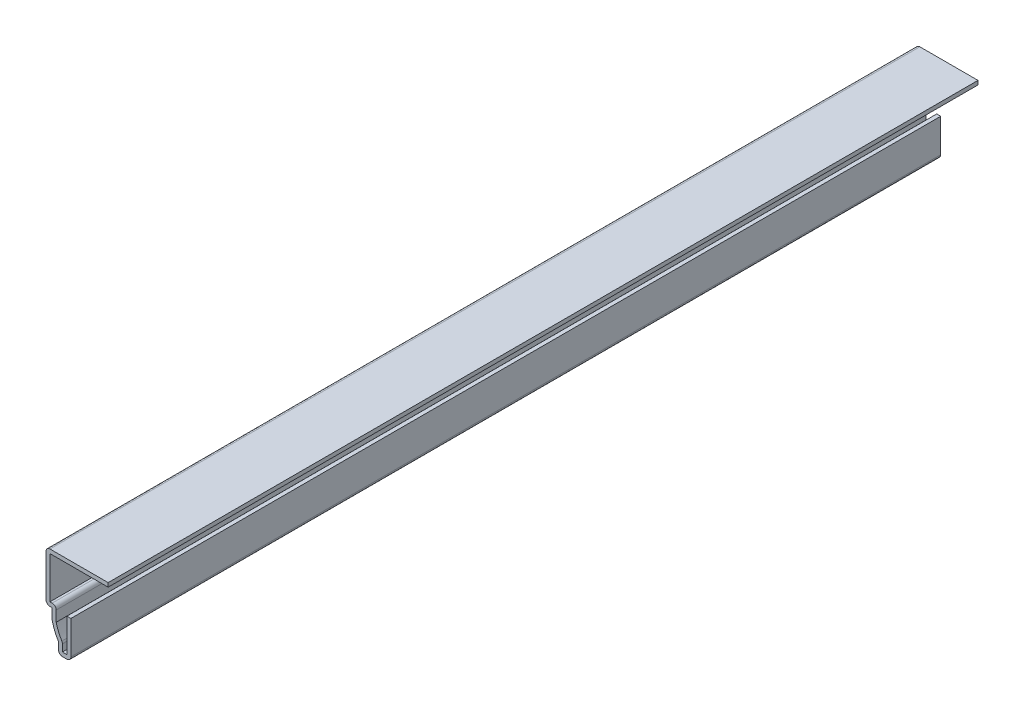
ISO-10303-21;
HEADER;
FILE_DESCRIPTION(('STEP AP214'),'2;1');
FILE_NAME('part.step','',(''),(''),'','','');
FILE_SCHEMA(('AUTOMOTIVE_DESIGN { 1 0 10303 214 1 1 1 1 }'));
ENDSEC;
DATA;
#1=APPLICATION_CONTEXT('core data for automotive mechanical design processes');
#2=APPLICATION_PROTOCOL_DEFINITION('international standard','automotive_design',2000,#1);
#3=PRODUCT_CONTEXT('',#1,'mechanical');
#4=PRODUCT('Part','Part','',(#3));
#5=PRODUCT_RELATED_PRODUCT_CATEGORY('part','',(#4));
#6=PRODUCT_DEFINITION_FORMATION('','',#4);
#7=PRODUCT_DEFINITION_CONTEXT('part definition',#1,'design');
#8=PRODUCT_DEFINITION('design','',#6,#7);
#9=PRODUCT_DEFINITION_SHAPE('','',#8);
#10=(LENGTH_UNIT() NAMED_UNIT(*) SI_UNIT(.MILLI.,.METRE.));
#11=(NAMED_UNIT(*) PLANE_ANGLE_UNIT() SI_UNIT($,.RADIAN.));
#12=(NAMED_UNIT(*) SI_UNIT($,.STERADIAN.) SOLID_ANGLE_UNIT());
#13=UNCERTAINTY_MEASURE_WITH_UNIT(LENGTH_MEASURE(1.E-05),#10,'distance_accuracy_value','');
#14=(GEOMETRIC_REPRESENTATION_CONTEXT(3) GLOBAL_UNCERTAINTY_ASSIGNED_CONTEXT((#13)) GLOBAL_UNIT_ASSIGNED_CONTEXT((#10,
#11,#12)) REPRESENTATION_CONTEXT('',''));
#15=CARTESIAN_POINT('',(0.,0.,0.));
#16=DIRECTION('',(0.,0.,1.));
#17=DIRECTION('',(1.,0.,0.));
#18=AXIS2_PLACEMENT_3D('',#15,#16,#17);
#19=CARTESIAN_POINT('',(-6.35,11.684,-222.25));
#20=DIRECTION('',(0.,-1.,0.));
#21=DIRECTION('',(0.,0.,-1.));
#22=AXIS2_PLACEMENT_3D('',#19,#20,#21);
#23=PLANE('',#22);
#24=DIRECTION('',(1.,0.,0.));
#25=VECTOR('',#24,1.);
#26=CARTESIAN_POINT('',(-6.35,11.684,0.));
#27=LINE('',#26,#25);
#28=CARTESIAN_POINT('',(-5.334,11.684,0.));
#29=VERTEX_POINT('',#28);
#30=CARTESIAN_POINT('',(9.525,11.684,0.));
#31=VERTEX_POINT('',#30);
#32=EDGE_CURVE('E272',#29,#31,#27,.T.);
#33=ORIENTED_EDGE('',*,*,#32,.F.);
#34=DIRECTION('',(0.,0.,1.));
#35=VECTOR('',#34,1.);
#36=CARTESIAN_POINT('',(-5.334,11.684,-222.25));
#37=LINE('',#36,#35);
#38=CARTESIAN_POINT('',(-5.334,11.684,-222.25));
#39=VERTEX_POINT('',#38);
#40=EDGE_CURVE('E227',#39,#29,#37,.T.);
#41=ORIENTED_EDGE('',*,*,#40,.F.);
#42=DIRECTION('',(1.,0.,0.));
#43=VECTOR('',#42,1.);
#44=CARTESIAN_POINT('',(-6.35,11.684,-222.25));
#45=LINE('',#44,#43);
#46=CARTESIAN_POINT('',(9.525,11.684,-222.25));
#47=VERTEX_POINT('',#46);
#48=EDGE_CURVE('E209',#39,#47,#45,.T.);
#49=ORIENTED_EDGE('',*,*,#48,.T.);
#50=DIRECTION('',(0.,0.,1.));
#51=VECTOR('',#50,1.);
#52=CARTESIAN_POINT('',(9.525,11.684,-222.25));
#53=LINE('',#52,#51);
#54=EDGE_CURVE('E217',#47,#31,#53,.T.);
#55=ORIENTED_EDGE('',*,*,#54,.T.);
#56=EDGE_LOOP('',(#33,#41,#49,#55));
#57=FACE_BOUND('',#56,.T.);
#58=ADVANCED_FACE('F35',(#57),#23,.T.);
#59=CARTESIAN_POINT('',(-5.334,0.,-222.25));
#60=DIRECTION('',(1.,0.,0.));
#61=DIRECTION('',(0.,0.,-1.));
#62=AXIS2_PLACEMENT_3D('',#59,#60,#61);
#63=PLANE('',#62);
#64=DIRECTION('',(0.,1.,0.));
#65=VECTOR('',#64,1.);
#66=CARTESIAN_POINT('',(-5.334,0.,0.));
#67=LINE('',#66,#65);
#68=CARTESIAN_POINT('',(-5.334,1.016,0.));
#69=VERTEX_POINT('',#68);
#70=EDGE_CURVE('E228',#69,#29,#67,.T.);
#71=ORIENTED_EDGE('',*,*,#70,.F.);
#72=DIRECTION('',(0.,0.,1.));
#73=VECTOR('',#72,1.);
#74=CARTESIAN_POINT('',(-5.334,1.016,-222.25));
#75=LINE('',#74,#73);
#76=CARTESIAN_POINT('',(-5.334,1.016,-222.25));
#77=VERTEX_POINT('',#76);
#78=EDGE_CURVE('E314',#77,#69,#75,.T.);
#79=ORIENTED_EDGE('',*,*,#78,.F.);
#80=DIRECTION('',(0.,1.,0.));
#81=VECTOR('',#80,1.);
#82=CARTESIAN_POINT('',(-5.334,0.,-222.25));
#83=LINE('',#82,#81);
#84=EDGE_CURVE('E225',#77,#39,#83,.T.);
#85=ORIENTED_EDGE('',*,*,#84,.T.);
#86=ORIENTED_EDGE('',*,*,#40,.T.);
#87=EDGE_LOOP('',(#71,#79,#85,#86));
#88=FACE_BOUND('',#87,.T.);
#89=ADVANCED_FACE('F414',(#88),#63,.T.);
#90=CARTESIAN_POINT('',(-4.7625,1.016,-222.25));
#91=DIRECTION('',(0.,1.,0.));
#92=DIRECTION('',(0.,0.,1.));
#93=AXIS2_PLACEMENT_3D('',#90,#91,#92);
#94=PLANE('',#93);
#95=DIRECTION('',(1.,0.,0.));
#96=VECTOR('',#95,1.);
#97=CARTESIAN_POINT('',(-4.7625,1.016,0.));
#98=LINE('',#97,#96);
#99=CARTESIAN_POINT('',(-4.7625,1.016,0.));
#100=VERTEX_POINT('',#99);
#101=EDGE_CURVE('E231',#100,#69,#98,.F.);
#102=ORIENTED_EDGE('',*,*,#101,.F.);
#103=DIRECTION('',(0.,0.,1.));
#104=VECTOR('',#103,1.);
#105=CARTESIAN_POINT('',(-4.7625,1.016,-222.25));
#106=LINE('',#105,#104);
#107=CARTESIAN_POINT('',(-4.7625,1.016,-222.25));
#108=VERTEX_POINT('',#107);
#109=EDGE_CURVE('E385',#100,#108,#106,.F.);
#110=ORIENTED_EDGE('',*,*,#109,.T.);
#111=DIRECTION('',(1.,0.,0.));
#112=VECTOR('',#111,1.);
#113=CARTESIAN_POINT('',(-4.7625,1.016,-222.25));
#114=LINE('',#113,#112);
#115=EDGE_CURVE('E269',#108,#77,#114,.F.);
#116=ORIENTED_EDGE('',*,*,#115,.T.);
#117=ORIENTED_EDGE('',*,*,#78,.T.);
#118=EDGE_LOOP('',(#102,#110,#116,#117));
#119=FACE_BOUND('',#118,.T.);
#120=ADVANCED_FACE('F499',(#119),#94,.T.);
#121=CARTESIAN_POINT('',(-3.7465,-2.83139924481161,-222.25));
#122=DIRECTION('',(1.,0.,0.));
#123=DIRECTION('',(0.,0.,-1.));
#124=AXIS2_PLACEMENT_3D('',#121,#122,#123);
#125=PLANE('',#124);
#126=DIRECTION('',(0.,1.,0.));
#127=VECTOR('',#126,1.);
#128=CARTESIAN_POINT('',(-3.7465,-2.83139924481161,-222.25));
#129=LINE('',#128,#127);
#130=CARTESIAN_POINT('',(-3.7465,-2.71427745279967,-222.25));
#131=VERTEX_POINT('',#130);
#132=CARTESIAN_POINT('',(-3.7465,0.,-222.25));
#133=VERTEX_POINT('',#132);
#134=EDGE_CURVE('E266',#131,#133,#129,.T.);
#135=ORIENTED_EDGE('',*,*,#134,.T.);
#136=DIRECTION('',(0.,0.,1.));
#137=VECTOR('',#136,1.);
#138=CARTESIAN_POINT('',(-3.7465,0.,-222.25));
#139=LINE('',#138,#137);
#140=CARTESIAN_POINT('',(-3.7465,0.,0.));
#141=VERTEX_POINT('',#140);
#142=EDGE_CURVE('E382',#133,#141,#139,.T.);
#143=ORIENTED_EDGE('',*,*,#142,.T.);
#144=DIRECTION('',(0.,1.,0.));
#145=VECTOR('',#144,1.);
#146=CARTESIAN_POINT('',(-3.7465,-2.83139924481161,0.));
#147=LINE('',#146,#145);
#148=CARTESIAN_POINT('',(-3.7465,-2.71427745279967,0.));
#149=VERTEX_POINT('',#148);
#150=EDGE_CURVE('E308',#149,#141,#147,.T.);
#151=ORIENTED_EDGE('',*,*,#150,.F.);
#152=DIRECTION('',(0.,0.,1.));
#153=VECTOR('',#152,1.);
#154=CARTESIAN_POINT('',(-3.7465,-2.71427745279967,-222.25));
#155=LINE('',#154,#153);
#156=EDGE_CURVE('E317',#131,#149,#155,.T.);
#157=ORIENTED_EDGE('',*,*,#156,.F.);
#158=EDGE_LOOP('',(#135,#143,#151,#157));
#159=FACE_BOUND('',#158,.T.);
#160=ADVANCED_FACE('F425',(#159),#125,.T.);
#161=CARTESIAN_POINT('',(7.61785453113037,0.,-222.25));
#162=DIRECTION('',(0.,0.,1.));
#163=DIRECTION('',(1.,0.,0.));
#164=AXIS2_PLACEMENT_3D('',#161,#162,#163);
#165=CYLINDRICAL_SURFACE('',#164,11.684);
#166=CARTESIAN_POINT('',(7.61785453113037,0.,0.));
#167=DIRECTION('',(0.,0.,1.));
#168=DIRECTION('',(1.,0.,0.));
#169=AXIS2_PLACEMENT_3D('',#166,#167,#168);
#170=CIRCLE('',#169,11.684);
#171=CARTESIAN_POINT('',(-2.31157163750957,-6.15811269477332,0.));
#172=VERTEX_POINT('',#171);
#173=EDGE_CURVE('E306',#172,#149,#170,.F.);
#174=ORIENTED_EDGE('',*,*,#173,.F.);
#175=DIRECTION('',(0.,0.,1.));
#176=VECTOR('',#175,1.);
#177=CARTESIAN_POINT('',(-2.31157163750957,-6.15811269477332,-222.25));
#178=LINE('',#177,#176);
#179=CARTESIAN_POINT('',(-2.31157163750957,-6.15811269477332,-222.25));
#180=VERTEX_POINT('',#179);
#181=EDGE_CURVE('E352',#172,#180,#178,.F.);
#182=ORIENTED_EDGE('',*,*,#181,.T.);
#183=CARTESIAN_POINT('',(7.61785453113037,0.,-222.25));
#184=DIRECTION('',(0.,0.,1.));
#185=DIRECTION('',(1.,0.,0.));
#186=AXIS2_PLACEMENT_3D('',#183,#184,#185);
#187=CIRCLE('',#186,11.684);
#188=EDGE_CURVE('E264',#180,#131,#187,.F.);
#189=ORIENTED_EDGE('',*,*,#188,.T.);
#190=ORIENTED_EDGE('',*,*,#156,.T.);
#191=EDGE_LOOP('',(#174,#182,#189,#190));
#192=FACE_BOUND('',#191,.T.);
#193=ADVANCED_FACE('F430',(#192),#165,.F.);
#194=CARTESIAN_POINT('',(-2.159,-9.525,-222.25));
#195=DIRECTION('',(1.,0.,0.));
#196=DIRECTION('',(0.,0.,-1.));
#197=AXIS2_PLACEMENT_3D('',#194,#195,#196);
#198=PLANE('',#197);
#199=DIRECTION('',(0.,1.,0.));
#200=VECTOR('',#199,1.);
#201=CARTESIAN_POINT('',(-2.159,-9.525,-222.25));
#202=LINE('',#201,#200);
#203=CARTESIAN_POINT('',(-2.159,-8.509,-222.25));
#204=VERTEX_POINT('',#203);
#205=CARTESIAN_POINT('',(-2.159,-6.69360075518839,-222.25));
#206=VERTEX_POINT('',#205);
#207=EDGE_CURVE('E261',#204,#206,#202,.T.);
#208=ORIENTED_EDGE('',*,*,#207,.T.);
#209=DIRECTION('',(0.,0.,1.));
#210=VECTOR('',#209,1.);
#211=CARTESIAN_POINT('',(-2.159,-6.69360075518839,-222.25));
#212=LINE('',#211,#210);
#213=CARTESIAN_POINT('',(-2.159,-6.69360075518839,0.));
#214=VERTEX_POINT('',#213);
#215=EDGE_CURVE('E313',#206,#214,#212,.T.);
#216=ORIENTED_EDGE('',*,*,#215,.T.);
#217=DIRECTION('',(0.,1.,0.));
#218=VECTOR('',#217,1.);
#219=CARTESIAN_POINT('',(-2.159,-9.525,0.));
#220=LINE('',#219,#218);
#221=CARTESIAN_POINT('',(-2.159,-8.509,0.));
#222=VERTEX_POINT('',#221);
#223=EDGE_CURVE('E303',#222,#214,#220,.T.);
#224=ORIENTED_EDGE('',*,*,#223,.F.);
#225=DIRECTION('',(0.,0.,1.));
#226=VECTOR('',#225,1.);
#227=CARTESIAN_POINT('',(-2.159,-8.509,-222.25));
#228=LINE('',#227,#226);
#229=EDGE_CURVE('E320',#204,#222,#228,.T.);
#230=ORIENTED_EDGE('',*,*,#229,.F.);
#231=EDGE_LOOP('',(#208,#216,#224,#230));
#232=FACE_BOUND('',#231,.T.);
#233=ADVANCED_FACE('F438',(#232),#198,.T.);
#234=CARTESIAN_POINT('',(0.,-8.509,-222.25));
#235=DIRECTION('',(0.,1.,0.));
#236=DIRECTION('',(0.,0.,1.));
#237=AXIS2_PLACEMENT_3D('',#234,#235,#236);
#238=PLANE('',#237);
#239=DIRECTION('',(1.,0.,0.));
#240=VECTOR('',#239,1.);
#241=CARTESIAN_POINT('',(0.,-8.509,0.));
#242=LINE('',#241,#240);
#243=CARTESIAN_POINT('',(-1.016,-8.509,0.));
#244=VERTEX_POINT('',#243);
#245=EDGE_CURVE('E300',#244,#222,#242,.F.);
#246=ORIENTED_EDGE('',*,*,#245,.F.);
#247=DIRECTION('',(0.,0.,1.));
#248=VECTOR('',#247,1.);
#249=CARTESIAN_POINT('',(-1.016,-8.509,-222.25));
#250=LINE('',#249,#248);
#251=CARTESIAN_POINT('',(-1.016,-8.509,-222.25));
#252=VERTEX_POINT('',#251);
#253=EDGE_CURVE('E322',#252,#244,#250,.T.);
#254=ORIENTED_EDGE('',*,*,#253,.F.);
#255=DIRECTION('',(1.,0.,0.));
#256=VECTOR('',#255,1.);
#257=CARTESIAN_POINT('',(0.,-8.509,-222.25));
#258=LINE('',#257,#256);
#259=EDGE_CURVE('E258',#252,#204,#258,.F.);
#260=ORIENTED_EDGE('',*,*,#259,.T.);
#261=ORIENTED_EDGE('',*,*,#229,.T.);
#262=EDGE_LOOP('',(#246,#254,#260,#261));
#263=FACE_BOUND('',#262,.T.);
#264=ADVANCED_FACE('F443',(#263),#238,.T.);
#265=CARTESIAN_POINT('',(-1.016,0.,-222.25));
#266=DIRECTION('',(-1.,0.,0.));
#267=DIRECTION('',(0.,0.,1.));
#268=AXIS2_PLACEMENT_3D('',#265,#266,#267);
#269=PLANE('',#268);
#270=DIRECTION('',(0.,1.,0.));
#271=VECTOR('',#270,1.);
#272=CARTESIAN_POINT('',(-1.016,0.,0.));
#273=LINE('',#272,#271);
#274=CARTESIAN_POINT('',(-1.016,0.,0.));
#275=VERTEX_POINT('',#274);
#276=EDGE_CURVE('E297',#275,#244,#273,.F.);
#277=ORIENTED_EDGE('',*,*,#276,.F.);
#278=DIRECTION('',(0.,0.,1.));
#279=VECTOR('',#278,1.);
#280=CARTESIAN_POINT('',(-1.016,0.,-222.25));
#281=LINE('',#280,#279);
#282=CARTESIAN_POINT('',(-1.016,0.,-222.25));
#283=VERTEX_POINT('',#282);
#284=EDGE_CURVE('E324',#283,#275,#281,.T.);
#285=ORIENTED_EDGE('',*,*,#284,.F.);
#286=DIRECTION('',(0.,1.,0.));
#287=VECTOR('',#286,1.);
#288=CARTESIAN_POINT('',(-1.016,0.,-222.25));
#289=LINE('',#288,#287);
#290=EDGE_CURVE('E255',#283,#252,#289,.F.);
#291=ORIENTED_EDGE('',*,*,#290,.T.);
#292=ORIENTED_EDGE('',*,*,#253,.T.);
#293=EDGE_LOOP('',(#277,#285,#291,#292));
#294=FACE_BOUND('',#293,.T.);
#295=ADVANCED_FACE('F447',(#294),#269,.T.);
#296=CARTESIAN_POINT('',(-1.016,0.,-222.25));
#297=DIRECTION('',(0.,-1.,0.));
#298=DIRECTION('',(0.,0.,-1.));
#299=AXIS2_PLACEMENT_3D('',#296,#297,#298);
#300=PLANE('',#299);
#301=DIRECTION('',(1.,0.,0.));
#302=VECTOR('',#301,1.);
#303=CARTESIAN_POINT('',(-1.016,0.,0.));
#304=LINE('',#303,#302);
#305=CARTESIAN_POINT('',(0.,0.,0.));
#306=VERTEX_POINT('',#305);
#307=EDGE_CURVE('E295',#275,#306,#304,.T.);
#308=ORIENTED_EDGE('',*,*,#307,.T.);
#309=DIRECTION('',(0.,0.,1.));
#310=VECTOR('',#309,1.);
#311=CARTESIAN_POINT('',(0.,0.,-222.25));
#312=LINE('',#311,#310);
#313=CARTESIAN_POINT('',(0.,0.,-222.25));
#314=VERTEX_POINT('',#313);
#315=EDGE_CURVE('E326',#314,#306,#312,.T.);
#316=ORIENTED_EDGE('',*,*,#315,.F.);
#317=DIRECTION('',(1.,0.,0.));
#318=VECTOR('',#317,1.);
#319=CARTESIAN_POINT('',(-1.016,0.,-222.25));
#320=LINE('',#319,#318);
#321=EDGE_CURVE('E253',#283,#314,#320,.T.);
#322=ORIENTED_EDGE('',*,*,#321,.F.);
#323=ORIENTED_EDGE('',*,*,#284,.T.);
#324=EDGE_LOOP('',(#308,#316,#322,#323));
#325=FACE_BOUND('',#324,.T.);
#326=ADVANCED_FACE('F451',(#325),#300,.F.);
#327=CARTESIAN_POINT('',(0.,0.,-222.25));
#328=DIRECTION('',(-1.,0.,0.));
#329=DIRECTION('',(0.,0.,1.));
#330=AXIS2_PLACEMENT_3D('',#327,#328,#329);
#331=PLANE('',#330);
#332=DIRECTION('',(0.,-1.,0.));
#333=VECTOR('',#332,1.);
#334=CARTESIAN_POINT('',(0.,0.,0.));
#335=LINE('',#334,#333);
#336=CARTESIAN_POINT('',(0.,-8.509,0.));
#337=VERTEX_POINT('',#336);
#338=EDGE_CURVE('E292',#306,#337,#335,.T.);
#339=ORIENTED_EDGE('',*,*,#338,.T.);
#340=DIRECTION('',(0.,0.,1.));
#341=VECTOR('',#340,1.);
#342=CARTESIAN_POINT('',(0.,-8.509,-222.25));
#343=LINE('',#342,#341);
#344=CARTESIAN_POINT('',(0.,-8.509,-222.25));
#345=VERTEX_POINT('',#344);
#346=EDGE_CURVE('E377',#337,#345,#343,.F.);
#347=ORIENTED_EDGE('',*,*,#346,.T.);
#348=DIRECTION('',(0.,-1.,0.));
#349=VECTOR('',#348,1.);
#350=CARTESIAN_POINT('',(0.,0.,-222.25));
#351=LINE('',#350,#349);
#352=EDGE_CURVE('E250',#314,#345,#351,.T.);
#353=ORIENTED_EDGE('',*,*,#352,.F.);
#354=ORIENTED_EDGE('',*,*,#315,.T.);
#355=EDGE_LOOP('',(#339,#347,#353,#354));
#356=FACE_BOUND('',#355,.T.);
#357=ADVANCED_FACE('F620',(#356),#331,.F.);
#358=CARTESIAN_POINT('',(0.,-9.525,-222.25));
#359=DIRECTION('',(0.,1.,0.));
#360=DIRECTION('',(0.,0.,1.));
#361=AXIS2_PLACEMENT_3D('',#358,#359,#360);
#362=PLANE('',#361);
#363=DIRECTION('',(-1.,0.,0.));
#364=VECTOR('',#363,1.);
#365=CARTESIAN_POINT('',(0.,-9.525,-222.25));
#366=LINE('',#365,#364);
#367=CARTESIAN_POINT('',(-1.016,-9.525,-222.25));
#368=VERTEX_POINT('',#367);
#369=CARTESIAN_POINT('',(-2.159,-9.525,-222.25));
#370=VERTEX_POINT('',#369);
#371=EDGE_CURVE('E247',#368,#370,#366,.T.);
#372=ORIENTED_EDGE('',*,*,#371,.F.);
#373=DIRECTION('',(0.,0.,1.));
#374=VECTOR('',#373,1.);
#375=CARTESIAN_POINT('',(-1.016,-9.525,-222.25));
#376=LINE('',#375,#374);
#377=CARTESIAN_POINT('',(-1.016,-9.525,0.));
#378=VERTEX_POINT('',#377);
#379=EDGE_CURVE('E374',#368,#378,#376,.T.);
#380=ORIENTED_EDGE('',*,*,#379,.T.);
#381=DIRECTION('',(-1.,0.,0.));
#382=VECTOR('',#381,1.);
#383=CARTESIAN_POINT('',(0.,-9.525,0.));
#384=LINE('',#383,#382);
#385=CARTESIAN_POINT('',(-2.159,-9.525,0.));
#386=VERTEX_POINT('',#385);
#387=EDGE_CURVE('E289',#378,#386,#384,.T.);
#388=ORIENTED_EDGE('',*,*,#387,.T.);
#389=DIRECTION('',(0.,0.,1.));
#390=VECTOR('',#389,1.);
#391=CARTESIAN_POINT('',(-2.159,-9.525,-222.25));
#392=LINE('',#391,#390);
#393=EDGE_CURVE('E372',#386,#370,#392,.F.);
#394=ORIENTED_EDGE('',*,*,#393,.T.);
#395=EDGE_LOOP('',(#372,#380,#388,#394));
#396=FACE_BOUND('',#395,.T.);
#397=ADVANCED_FACE('F462',(#396),#362,.F.);
#398=CARTESIAN_POINT('',(-3.175,-9.525,-222.25));
#399=DIRECTION('',(1.,0.,0.));
#400=DIRECTION('',(0.,0.,-1.));
#401=AXIS2_PLACEMENT_3D('',#398,#399,#400);
#402=PLANE('',#401);
#403=DIRECTION('',(0.,1.,0.));
#404=VECTOR('',#403,1.);
#405=CARTESIAN_POINT('',(-3.175,-9.525,-222.25));
#406=LINE('',#405,#404);
#407=CARTESIAN_POINT('',(-3.175,-8.509,-222.25));
#408=VERTEX_POINT('',#407);
#409=CARTESIAN_POINT('',(-3.175,-6.6936007551884,-222.25));
#410=VERTEX_POINT('',#409);
#411=EDGE_CURVE('E245',#408,#410,#406,.T.);
#412=ORIENTED_EDGE('',*,*,#411,.F.);
#413=DIRECTION('',(0.,0.,1.));
#414=VECTOR('',#413,1.);
#415=CARTESIAN_POINT('',(-3.175,-8.509,-222.25));
#416=LINE('',#415,#414);
#417=CARTESIAN_POINT('',(-3.175,-8.509,0.));
#418=VERTEX_POINT('',#417);
#419=EDGE_CURVE('E379',#408,#418,#416,.T.);
#420=ORIENTED_EDGE('',*,*,#419,.T.);
#421=DIRECTION('',(0.,1.,0.));
#422=VECTOR('',#421,1.);
#423=CARTESIAN_POINT('',(-3.175,-9.525,0.));
#424=LINE('',#423,#422);
#425=CARTESIAN_POINT('',(-3.175,-6.6936007551884,0.));
#426=VERTEX_POINT('',#425);
#427=EDGE_CURVE('E287',#418,#426,#424,.T.);
#428=ORIENTED_EDGE('',*,*,#427,.T.);
#429=DIRECTION('',(0.,0.,1.));
#430=VECTOR('',#429,1.);
#431=CARTESIAN_POINT('',(-3.175,-6.6936007551884,-222.25));
#432=LINE('',#431,#430);
#433=EDGE_CURVE('E329',#410,#426,#432,.T.);
#434=ORIENTED_EDGE('',*,*,#433,.F.);
#435=EDGE_LOOP('',(#412,#420,#428,#434));
#436=FACE_BOUND('',#435,.T.);
#437=ADVANCED_FACE('F473',(#436),#402,.F.);
#438=CARTESIAN_POINT('',(7.61785453113037,0.,-222.25));
#439=DIRECTION('',(0.,0.,1.));
#440=DIRECTION('',(1.,0.,0.));
#441=AXIS2_PLACEMENT_3D('',#438,#439,#440);
#442=CYLINDRICAL_SURFACE('',#441,12.7);
#443=CARTESIAN_POINT('',(7.61785453113037,0.,0.));
#444=DIRECTION('',(0.,0.,-1.));
#445=DIRECTION('',(1.,0.,0.));
#446=AXIS2_PLACEMENT_3D('',#443,#444,#445);
#447=CIRCLE('',#446,12.7);
#448=CARTESIAN_POINT('',(-4.73470474183742,-2.95030157913009,0.));
#449=VERTEX_POINT('',#448);
#450=EDGE_CURVE('E284',#426,#449,#447,.T.);
#451=ORIENTED_EDGE('',*,*,#450,.T.);
#452=DIRECTION('',(0.,0.,1.));
#453=VECTOR('',#452,1.);
#454=CARTESIAN_POINT('',(-4.73470474183742,-2.95030157913009,-222.25));
#455=LINE('',#454,#453);
#456=CARTESIAN_POINT('',(-4.73470474183742,-2.95030157913009,-222.25));
#457=VERTEX_POINT('',#456);
#458=EDGE_CURVE('E370',#449,#457,#455,.F.);
#459=ORIENTED_EDGE('',*,*,#458,.T.);
#460=CARTESIAN_POINT('',(7.61785453113037,0.,-222.25));
#461=DIRECTION('',(0.,0.,-1.));
#462=DIRECTION('',(1.,0.,0.));
#463=AXIS2_PLACEMENT_3D('',#460,#461,#462);
#464=CIRCLE('',#463,12.7);
#465=EDGE_CURVE('E242',#410,#457,#464,.T.);
#466=ORIENTED_EDGE('',*,*,#465,.F.);
#467=ORIENTED_EDGE('',*,*,#433,.T.);
#468=EDGE_LOOP('',(#451,#459,#466,#467));
#469=FACE_BOUND('',#468,.T.);
#470=ADVANCED_FACE('F485',(#469),#442,.T.);
#471=CARTESIAN_POINT('',(-4.7625,-2.83139924481161,-222.25));
#472=DIRECTION('',(1.,0.,0.));
#473=DIRECTION('',(0.,0.,-1.));
#474=AXIS2_PLACEMENT_3D('',#471,#472,#473);
#475=PLANE('',#474);
#476=DIRECTION('',(0.,1.,0.));
#477=VECTOR('',#476,1.);
#478=CARTESIAN_POINT('',(-4.7625,-2.83139924481161,-222.25));
#479=LINE('',#478,#477);
#480=CARTESIAN_POINT('',(-4.7625,-2.71427745279968,-222.25));
#481=VERTEX_POINT('',#480);
#482=CARTESIAN_POINT('',(-4.7625,0.,-222.25));
#483=VERTEX_POINT('',#482);
#484=EDGE_CURVE('E240',#481,#483,#479,.T.);
#485=ORIENTED_EDGE('',*,*,#484,.F.);
#486=DIRECTION('',(0.,0.,1.));
#487=VECTOR('',#486,1.);
#488=CARTESIAN_POINT('',(-4.7625,-2.71427745279968,-222.25));
#489=LINE('',#488,#487);
#490=CARTESIAN_POINT('',(-4.7625,-2.71427745279968,0.));
#491=VERTEX_POINT('',#490);
#492=EDGE_CURVE('E367',#481,#491,#489,.T.);
#493=ORIENTED_EDGE('',*,*,#492,.T.);
#494=DIRECTION('',(0.,1.,0.));
#495=VECTOR('',#494,1.);
#496=CARTESIAN_POINT('',(-4.7625,-2.83139924481161,0.));
#497=LINE('',#496,#495);
#498=CARTESIAN_POINT('',(-4.7625,0.,0.));
#499=VERTEX_POINT('',#498);
#500=EDGE_CURVE('E282',#491,#499,#497,.T.);
#501=ORIENTED_EDGE('',*,*,#500,.T.);
#502=DIRECTION('',(0.,0.,1.));
#503=VECTOR('',#502,1.);
#504=CARTESIAN_POINT('',(-4.7625,0.,-222.25));
#505=LINE('',#504,#503);
#506=EDGE_CURVE('E332',#483,#499,#505,.T.);
#507=ORIENTED_EDGE('',*,*,#506,.F.);
#508=EDGE_LOOP('',(#485,#493,#501,#507));
#509=FACE_BOUND('',#508,.T.);
#510=ADVANCED_FACE('F484',(#509),#475,.F.);
#511=CARTESIAN_POINT('',(-4.7625,0.,-222.25));
#512=DIRECTION('',(0.,1.,0.));
#513=DIRECTION('',(0.,0.,1.));
#514=AXIS2_PLACEMENT_3D('',#511,#512,#513);
#515=PLANE('',#514);
#516=DIRECTION('',(-1.,0.,0.));
#517=VECTOR('',#516,1.);
#518=CARTESIAN_POINT('',(-4.7625,0.,0.));
#519=LINE('',#518,#517);
#520=CARTESIAN_POINT('',(-5.334,0.,0.));
#521=VERTEX_POINT('',#520);
#522=EDGE_CURVE('E279',#499,#521,#519,.T.);
#523=ORIENTED_EDGE('',*,*,#522,.T.);
#524=DIRECTION('',(0.,0.,1.));
#525=VECTOR('',#524,1.);
#526=CARTESIAN_POINT('',(-5.334,0.,-222.25));
#527=LINE('',#526,#525);
#528=CARTESIAN_POINT('',(-5.334,0.,-222.25));
#529=VERTEX_POINT('',#528);
#530=EDGE_CURVE('E43',#521,#529,#527,.F.);
#531=ORIENTED_EDGE('',*,*,#530,.T.);
#532=DIRECTION('',(-1.,0.,0.));
#533=VECTOR('',#532,1.);
#534=CARTESIAN_POINT('',(-4.7625,0.,-222.25));
#535=LINE('',#534,#533);
#536=EDGE_CURVE('E237',#483,#529,#535,.T.);
#537=ORIENTED_EDGE('',*,*,#536,.F.);
#538=ORIENTED_EDGE('',*,*,#506,.T.);
#539=EDGE_LOOP('',(#523,#531,#537,#538));
#540=FACE_BOUND('',#539,.T.);
#541=ADVANCED_FACE('F393',(#540),#515,.F.);
#542=CARTESIAN_POINT('',(-6.35,0.,-222.25));
#543=DIRECTION('',(1.,0.,0.));
#544=DIRECTION('',(0.,0.,-1.));
#545=AXIS2_PLACEMENT_3D('',#542,#543,#544);
#546=PLANE('',#545);
#547=DIRECTION('',(0.,1.,0.));
#548=VECTOR('',#547,1.);
#549=CARTESIAN_POINT('',(-6.35,0.,-222.25));
#550=LINE('',#549,#548);
#551=CARTESIAN_POINT('',(-6.35,1.016,-222.25));
#552=VERTEX_POINT('',#551);
#553=CARTESIAN_POINT('',(-6.35,11.684,-222.25));
#554=VERTEX_POINT('',#553);
#555=EDGE_CURVE('E235',#552,#554,#550,.T.);
#556=ORIENTED_EDGE('',*,*,#555,.F.);
#557=DIRECTION('',(0.,0.,1.));
#558=VECTOR('',#557,1.);
#559=CARTESIAN_POINT('',(-6.35,1.016,-222.25));
#560=LINE('',#559,#558);
#561=CARTESIAN_POINT('',(-6.35,1.016,0.));
#562=VERTEX_POINT('',#561);
#563=EDGE_CURVE('E388',#552,#562,#560,.T.);
#564=ORIENTED_EDGE('',*,*,#563,.T.);
#565=DIRECTION('',(0.,1.,0.));
#566=VECTOR('',#565,1.);
#567=CARTESIAN_POINT('',(-6.35,0.,0.));
#568=LINE('',#567,#566);
#569=CARTESIAN_POINT('',(-6.35,11.684,0.));
#570=VERTEX_POINT('',#569);
#571=EDGE_CURVE('E277',#562,#570,#568,.T.);
#572=ORIENTED_EDGE('',*,*,#571,.T.);
#573=DIRECTION('',(0.,0.,1.));
#574=VECTOR('',#573,1.);
#575=CARTESIAN_POINT('',(-6.35,11.684,-222.25));
#576=LINE('',#575,#574);
#577=EDGE_CURVE('E58',#570,#554,#576,.F.);
#578=ORIENTED_EDGE('',*,*,#577,.T.);
#579=EDGE_LOOP('',(#556,#564,#572,#578));
#580=FACE_BOUND('',#579,.T.);
#581=ADVANCED_FACE('F402',(#580),#546,.F.);
#582=CARTESIAN_POINT('',(-6.35,12.7,-222.25));
#583=DIRECTION('',(0.,-1.,0.));
#584=DIRECTION('',(0.,0.,-1.));
#585=AXIS2_PLACEMENT_3D('',#582,#583,#584);
#586=PLANE('',#585);
#587=DIRECTION('',(1.,0.,0.));
#588=VECTOR('',#587,1.);
#589=CARTESIAN_POINT('',(-6.35,12.7,-222.25));
#590=LINE('',#589,#588);
#591=CARTESIAN_POINT('',(-5.334,12.7,-222.25));
#592=VERTEX_POINT('',#591);
#593=CARTESIAN_POINT('',(9.525,12.7,-222.25));
#594=VERTEX_POINT('',#593);
#595=EDGE_CURVE('E211',#592,#594,#590,.T.);
#596=ORIENTED_EDGE('',*,*,#595,.F.);
#597=DIRECTION('',(0.,0.,1.));
#598=VECTOR('',#597,1.);
#599=CARTESIAN_POINT('',(-5.334,12.7,-222.25));
#600=LINE('',#599,#598);
#601=CARTESIAN_POINT('',(-5.334,12.7,0.));
#602=VERTEX_POINT('',#601);
#603=EDGE_CURVE('E11',#592,#602,#600,.T.);
#604=ORIENTED_EDGE('',*,*,#603,.T.);
#605=DIRECTION('',(1.,0.,0.));
#606=VECTOR('',#605,1.);
#607=CARTESIAN_POINT('',(-6.35,12.7,0.));
#608=LINE('',#607,#606);
#609=CARTESIAN_POINT('',(9.525,12.7,0.));
#610=VERTEX_POINT('',#609);
#611=EDGE_CURVE('E275',#602,#610,#608,.T.);
#612=ORIENTED_EDGE('',*,*,#611,.T.);
#613=DIRECTION('',(0.,0.,1.));
#614=VECTOR('',#613,1.);
#615=CARTESIAN_POINT('',(9.525,12.7,-222.25));
#616=LINE('',#615,#614);
#617=EDGE_CURVE('E224',#594,#610,#616,.T.);
#618=ORIENTED_EDGE('',*,*,#617,.F.);
#619=EDGE_LOOP('',(#596,#604,#612,#618));
#620=FACE_BOUND('',#619,.T.);
#621=ADVANCED_FACE('F409',(#620),#586,.F.);
#622=CARTESIAN_POINT('',(9.525,12.7,-222.25));
#623=DIRECTION('',(-1.,0.,0.));
#624=DIRECTION('',(0.,0.,1.));
#625=AXIS2_PLACEMENT_3D('',#622,#623,#624);
#626=PLANE('',#625);
#627=DIRECTION('',(0.,-1.,0.));
#628=VECTOR('',#627,1.);
#629=CARTESIAN_POINT('',(9.525,12.7,0.));
#630=LINE('',#629,#628);
#631=EDGE_CURVE('E220',#610,#31,#630,.T.);
#632=ORIENTED_EDGE('',*,*,#631,.T.);
#633=ORIENTED_EDGE('',*,*,#54,.F.);
#634=DIRECTION('',(0.,-1.,0.));
#635=VECTOR('',#634,1.);
#636=CARTESIAN_POINT('',(9.525,12.7,-222.25));
#637=LINE('',#636,#635);
#638=EDGE_CURVE('E203',#594,#47,#637,.T.);
#639=ORIENTED_EDGE('',*,*,#638,.F.);
#640=ORIENTED_EDGE('',*,*,#617,.T.);
#641=EDGE_LOOP('',(#632,#633,#639,#640));
#642=FACE_BOUND('',#641,.T.);
#643=ADVANCED_FACE('F218',(#642),#626,.F.);
#644=CARTESIAN_POINT('',(7.61785453113037,0.,-222.25));
#645=DIRECTION('',(0.,0.,-1.));
#646=DIRECTION('',(-1.,0.,0.));
#647=AXIS2_PLACEMENT_3D('',#644,#645,#646);
#648=PLANE('',#647);
#649=ORIENTED_EDGE('',*,*,#188,.F.);
#650=CARTESIAN_POINT('',(-3.175,-6.69360075518839,-222.25));
#651=DIRECTION('',(0.,0.,-1.));
#652=DIRECTION('',(-1.,0.,0.));
#653=AXIS2_PLACEMENT_3D('',#650,#651,#652);
#654=CIRCLE('',#653,1.016);
#655=EDGE_CURVE('E365',#180,#206,#654,.T.);
#656=ORIENTED_EDGE('',*,*,#655,.T.);
#657=ORIENTED_EDGE('',*,*,#207,.F.);
#658=ORIENTED_EDGE('',*,*,#259,.F.);
#659=ORIENTED_EDGE('',*,*,#290,.F.);
#660=ORIENTED_EDGE('',*,*,#321,.T.);
#661=ORIENTED_EDGE('',*,*,#352,.T.);
#662=CARTESIAN_POINT('',(-1.016,-8.509,-222.25));
#663=DIRECTION('',(0.,0.,-1.));
#664=DIRECTION('',(-1.,0.,0.));
#665=AXIS2_PLACEMENT_3D('',#662,#663,#664);
#666=CIRCLE('',#665,1.016);
#667=EDGE_CURVE('E361',#345,#368,#666,.T.);
#668=ORIENTED_EDGE('',*,*,#667,.T.);
#669=ORIENTED_EDGE('',*,*,#371,.T.);
#670=CARTESIAN_POINT('',(-2.159,-8.509,-222.25));
#671=DIRECTION('',(0.,0.,-1.));
#672=DIRECTION('',(-1.,0.,0.));
#673=AXIS2_PLACEMENT_3D('',#670,#671,#672);
#674=CIRCLE('',#673,1.016);
#675=EDGE_CURVE('E359',#370,#408,#674,.T.);
#676=ORIENTED_EDGE('',*,*,#675,.T.);
#677=ORIENTED_EDGE('',*,*,#411,.T.);
#678=ORIENTED_EDGE('',*,*,#465,.T.);
#679=CARTESIAN_POINT('',(-3.74649999999999,-2.71427745279968,-222.25));
#680=DIRECTION('',(0.,0.,-1.));
#681=DIRECTION('',(-1.,0.,0.));
#682=AXIS2_PLACEMENT_3D('',#679,#680,#681);
#683=CIRCLE('',#682,1.016);
#684=EDGE_CURVE('E363',#457,#481,#683,.T.);
#685=ORIENTED_EDGE('',*,*,#684,.T.);
#686=ORIENTED_EDGE('',*,*,#484,.T.);
#687=ORIENTED_EDGE('',*,*,#536,.T.);
#688=CARTESIAN_POINT('',(-5.334,1.016,-222.25));
#689=DIRECTION('',(0.,0.,-1.));
#690=DIRECTION('',(-1.,0.,0.));
#691=AXIS2_PLACEMENT_3D('',#688,#689,#690);
#692=CIRCLE('',#691,1.016);
#693=EDGE_CURVE('E355',#529,#552,#692,.T.);
#694=ORIENTED_EDGE('',*,*,#693,.T.);
#695=ORIENTED_EDGE('',*,*,#555,.T.);
#696=CARTESIAN_POINT('',(-5.334,11.684,-222.25));
#697=DIRECTION('',(0.,0.,-1.));
#698=DIRECTION('',(-1.,0.,0.));
#699=AXIS2_PLACEMENT_3D('',#696,#697,#698);
#700=CIRCLE('',#699,1.016);
#701=EDGE_CURVE('E50',#554,#592,#700,.T.);
#702=ORIENTED_EDGE('',*,*,#701,.T.);
#703=ORIENTED_EDGE('',*,*,#595,.T.);
#704=ORIENTED_EDGE('',*,*,#638,.T.);
#705=ORIENTED_EDGE('',*,*,#48,.F.);
#706=ORIENTED_EDGE('',*,*,#84,.F.);
#707=ORIENTED_EDGE('',*,*,#115,.F.);
#708=CARTESIAN_POINT('',(-4.7625,0.,-222.25));
#709=DIRECTION('',(0.,0.,-1.));
#710=DIRECTION('',(-1.,0.,0.));
#711=AXIS2_PLACEMENT_3D('',#708,#709,#710);
#712=CIRCLE('',#711,1.016);
#713=EDGE_CURVE('E357',#108,#133,#712,.T.);
#714=ORIENTED_EDGE('',*,*,#713,.T.);
#715=ORIENTED_EDGE('',*,*,#134,.F.);
#716=EDGE_LOOP('',(#649,#656,#657,#658,#659,#660,#661,#668,#669,#676,#677,#678,#685,#686,#687,
#694,#695,#702,#703,#704,#705,#706,#707,#714,#715));
#717=FACE_BOUND('',#716,.T.);
#718=ADVANCED_FACE('F206',(#717),#648,.T.);
#719=CARTESIAN_POINT('',(7.61785453113037,0.,0.));
#720=DIRECTION('',(0.,0.,-1.));
#721=DIRECTION('',(-1.,0.,0.));
#722=AXIS2_PLACEMENT_3D('',#719,#720,#721);
#723=PLANE('',#722);
#724=ORIENTED_EDGE('',*,*,#223,.T.);
#725=CARTESIAN_POINT('',(-3.175,-6.69360075518839,0.));
#726=DIRECTION('',(0.,0.,-1.));
#727=DIRECTION('',(-1.,0.,0.));
#728=AXIS2_PLACEMENT_3D('',#725,#726,#727);
#729=CIRCLE('',#728,1.016);
#730=EDGE_CURVE('E350',#214,#172,#729,.F.);
#731=ORIENTED_EDGE('',*,*,#730,.T.);
#732=ORIENTED_EDGE('',*,*,#173,.T.);
#733=ORIENTED_EDGE('',*,*,#150,.T.);
#734=CARTESIAN_POINT('',(-4.7625,0.,0.));
#735=DIRECTION('',(0.,0.,-1.));
#736=DIRECTION('',(-1.,0.,0.));
#737=AXIS2_PLACEMENT_3D('',#734,#735,#736);
#738=CIRCLE('',#737,1.016);
#739=EDGE_CURVE('E342',#141,#100,#738,.F.);
#740=ORIENTED_EDGE('',*,*,#739,.T.);
#741=ORIENTED_EDGE('',*,*,#101,.T.);
#742=ORIENTED_EDGE('',*,*,#70,.T.);
#743=ORIENTED_EDGE('',*,*,#32,.T.);
#744=ORIENTED_EDGE('',*,*,#631,.F.);
#745=ORIENTED_EDGE('',*,*,#611,.F.);
#746=CARTESIAN_POINT('',(-5.334,11.684,0.));
#747=DIRECTION('',(0.,0.,-1.));
#748=DIRECTION('',(-1.,0.,0.));
#749=AXIS2_PLACEMENT_3D('',#746,#747,#748);
#750=CIRCLE('',#749,1.016);
#751=EDGE_CURVE('E338',#602,#570,#750,.F.);
#752=ORIENTED_EDGE('',*,*,#751,.T.);
#753=ORIENTED_EDGE('',*,*,#571,.F.);
#754=CARTESIAN_POINT('',(-5.334,1.016,0.));
#755=DIRECTION('',(0.,0.,-1.));
#756=DIRECTION('',(-1.,0.,0.));
#757=AXIS2_PLACEMENT_3D('',#754,#755,#756);
#758=CIRCLE('',#757,1.016);
#759=EDGE_CURVE('E340',#562,#521,#758,.F.);
#760=ORIENTED_EDGE('',*,*,#759,.T.);
#761=ORIENTED_EDGE('',*,*,#522,.F.);
#762=ORIENTED_EDGE('',*,*,#500,.F.);
#763=CARTESIAN_POINT('',(-3.74649999999999,-2.71427745279968,0.));
#764=DIRECTION('',(0.,0.,-1.));
#765=DIRECTION('',(-1.,0.,0.));
#766=AXIS2_PLACEMENT_3D('',#763,#764,#765);
#767=CIRCLE('',#766,1.016);
#768=EDGE_CURVE('E348',#491,#449,#767,.F.);
#769=ORIENTED_EDGE('',*,*,#768,.T.);
#770=ORIENTED_EDGE('',*,*,#450,.F.);
#771=ORIENTED_EDGE('',*,*,#427,.F.);
#772=CARTESIAN_POINT('',(-2.159,-8.509,0.));
#773=DIRECTION('',(0.,0.,-1.));
#774=DIRECTION('',(-1.,0.,0.));
#775=AXIS2_PLACEMENT_3D('',#772,#773,#774);
#776=CIRCLE('',#775,1.016);
#777=EDGE_CURVE('E344',#418,#386,#776,.F.);
#778=ORIENTED_EDGE('',*,*,#777,.T.);
#779=ORIENTED_EDGE('',*,*,#387,.F.);
#780=CARTESIAN_POINT('',(-1.016,-8.509,0.));
#781=DIRECTION('',(0.,0.,-1.));
#782=DIRECTION('',(-1.,0.,0.));
#783=AXIS2_PLACEMENT_3D('',#780,#781,#782);
#784=CIRCLE('',#783,1.016);
#785=EDGE_CURVE('E346',#378,#337,#784,.F.);
#786=ORIENTED_EDGE('',*,*,#785,.T.);
#787=ORIENTED_EDGE('',*,*,#338,.F.);
#788=ORIENTED_EDGE('',*,*,#307,.F.);
#789=ORIENTED_EDGE('',*,*,#276,.T.);
#790=ORIENTED_EDGE('',*,*,#245,.T.);
#791=EDGE_LOOP('',(#724,#731,#732,#733,#740,#741,#742,#743,#744,#745,#752,#753,#760,#761,#762,
#769,#770,#771,#778,#779,#786,#787,#788,#789,#790));
#792=FACE_BOUND('',#791,.T.);
#793=ADVANCED_FACE('F404',(#792),#723,.F.);
#794=CARTESIAN_POINT('',(-3.175,-6.69360075518839,-222.25));
#795=DIRECTION('',(0.,0.,1.));
#796=DIRECTION('',(1.,0.,0.));
#797=AXIS2_PLACEMENT_3D('',#794,#795,#796);
#798=CYLINDRICAL_SURFACE('',#797,1.016);
#799=ORIENTED_EDGE('',*,*,#655,.F.);
#800=ORIENTED_EDGE('',*,*,#181,.F.);
#801=ORIENTED_EDGE('',*,*,#730,.F.);
#802=ORIENTED_EDGE('',*,*,#215,.F.);
#803=EDGE_LOOP('',(#799,#800,#801,#802));
#804=FACE_BOUND('',#803,.T.);
#805=ADVANCED_FACE('F435',(#804),#798,.T.);
#806=CARTESIAN_POINT('',(-3.74649999999999,-2.71427745279968,-222.25));
#807=DIRECTION('',(0.,0.,1.));
#808=DIRECTION('',(1.,0.,0.));
#809=AXIS2_PLACEMENT_3D('',#806,#807,#808);
#810=CYLINDRICAL_SURFACE('',#809,1.016);
#811=ORIENTED_EDGE('',*,*,#684,.F.);
#812=ORIENTED_EDGE('',*,*,#458,.F.);
#813=ORIENTED_EDGE('',*,*,#768,.F.);
#814=ORIENTED_EDGE('',*,*,#492,.F.);
#815=EDGE_LOOP('',(#811,#812,#813,#814));
#816=FACE_BOUND('',#815,.T.);
#817=ADVANCED_FACE('F481',(#816),#810,.T.);
#818=CARTESIAN_POINT('',(-1.016,-8.509,-222.25));
#819=DIRECTION('',(0.,0.,1.));
#820=DIRECTION('',(1.,0.,0.));
#821=AXIS2_PLACEMENT_3D('',#818,#819,#820);
#822=CYLINDRICAL_SURFACE('',#821,1.016);
#823=ORIENTED_EDGE('',*,*,#667,.F.);
#824=ORIENTED_EDGE('',*,*,#346,.F.);
#825=ORIENTED_EDGE('',*,*,#785,.F.);
#826=ORIENTED_EDGE('',*,*,#379,.F.);
#827=EDGE_LOOP('',(#823,#824,#825,#826));
#828=FACE_BOUND('',#827,.T.);
#829=ADVANCED_FACE('F459',(#828),#822,.T.);
#830=CARTESIAN_POINT('',(-2.159,-8.509,-222.25));
#831=DIRECTION('',(0.,0.,1.));
#832=DIRECTION('',(1.,0.,0.));
#833=AXIS2_PLACEMENT_3D('',#830,#831,#832);
#834=CYLINDRICAL_SURFACE('',#833,1.016);
#835=ORIENTED_EDGE('',*,*,#675,.F.);
#836=ORIENTED_EDGE('',*,*,#393,.F.);
#837=ORIENTED_EDGE('',*,*,#777,.F.);
#838=ORIENTED_EDGE('',*,*,#419,.F.);
#839=EDGE_LOOP('',(#835,#836,#837,#838));
#840=FACE_BOUND('',#839,.T.);
#841=ADVANCED_FACE('F470',(#840),#834,.T.);
#842=CARTESIAN_POINT('',(-4.7625,0.,-222.25));
#843=DIRECTION('',(0.,0.,1.));
#844=DIRECTION('',(1.,0.,0.));
#845=AXIS2_PLACEMENT_3D('',#842,#843,#844);
#846=CYLINDRICAL_SURFACE('',#845,1.016);
#847=ORIENTED_EDGE('',*,*,#713,.F.);
#848=ORIENTED_EDGE('',*,*,#109,.F.);
#849=ORIENTED_EDGE('',*,*,#739,.F.);
#850=ORIENTED_EDGE('',*,*,#142,.F.);
#851=EDGE_LOOP('',(#847,#848,#849,#850));
#852=FACE_BOUND('',#851,.T.);
#853=ADVANCED_FACE('F422',(#852),#846,.T.);
#854=CARTESIAN_POINT('',(-5.334,1.016,-222.25));
#855=DIRECTION('',(0.,0.,1.));
#856=DIRECTION('',(1.,0.,0.));
#857=AXIS2_PLACEMENT_3D('',#854,#855,#856);
#858=CYLINDRICAL_SURFACE('',#857,1.016);
#859=ORIENTED_EDGE('',*,*,#693,.F.);
#860=ORIENTED_EDGE('',*,*,#530,.F.);
#861=ORIENTED_EDGE('',*,*,#759,.F.);
#862=ORIENTED_EDGE('',*,*,#563,.F.);
#863=EDGE_LOOP('',(#859,#860,#861,#862));
#864=FACE_BOUND('',#863,.T.);
#865=ADVANCED_FACE('F400',(#864),#858,.T.);
#866=CARTESIAN_POINT('',(-5.334,11.684,-222.25));
#867=DIRECTION('',(0.,0.,1.));
#868=DIRECTION('',(1.,0.,0.));
#869=AXIS2_PLACEMENT_3D('',#866,#867,#868);
#870=CYLINDRICAL_SURFACE('',#869,1.016);
#871=ORIENTED_EDGE('',*,*,#701,.F.);
#872=ORIENTED_EDGE('',*,*,#577,.F.);
#873=ORIENTED_EDGE('',*,*,#751,.F.);
#874=ORIENTED_EDGE('',*,*,#603,.F.);
#875=EDGE_LOOP('',(#871,#872,#873,#874));
#876=FACE_BOUND('',#875,.T.);
#877=ADVANCED_FACE('F37',(#876),#870,.T.);
#878=CLOSED_SHELL('',(#58,#89,#120,#160,#193,#233,#264,#295,#326,#357,#397,#437,#470,#510,#541,
#581,#621,#643,#718,#793,#805,#817,#829,#841,#853,#865,#877));
#879=MANIFOLD_SOLID_BREP('B2',#878);
#880=ADVANCED_BREP_SHAPE_REPRESENTATION('',(#18,#879),#14);
#881=SHAPE_DEFINITION_REPRESENTATION(#9,#880);
ENDSEC;
END-ISO-10303-21;
